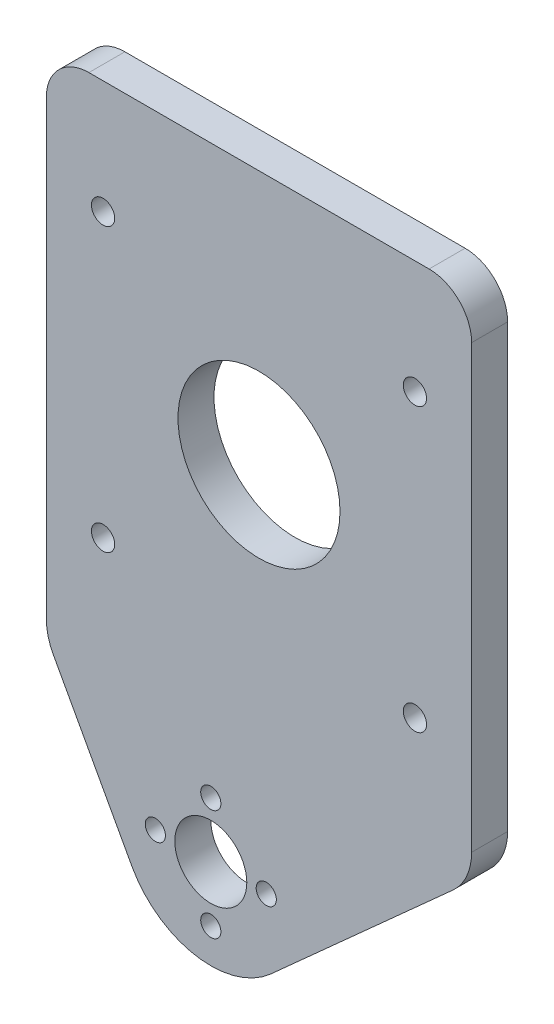
ISO-10303-21;
HEADER;
FILE_DESCRIPTION(('STEP AP214'),'2;1');
FILE_NAME('part.step','',(''),(''),'','','');
FILE_SCHEMA(('AUTOMOTIVE_DESIGN { 1 0 10303 214 1 1 1 1 }'));
ENDSEC;
DATA;
#1=APPLICATION_CONTEXT('core data for automotive mechanical design processes');
#2=APPLICATION_PROTOCOL_DEFINITION('international standard','automotive_design',2000,#1);
#3=PRODUCT_CONTEXT('',#1,'mechanical');
#4=PRODUCT('Part','Part','',(#3));
#5=PRODUCT_RELATED_PRODUCT_CATEGORY('part','',(#4));
#6=PRODUCT_DEFINITION_FORMATION('','',#4);
#7=PRODUCT_DEFINITION_CONTEXT('part definition',#1,'design');
#8=PRODUCT_DEFINITION('design','',#6,#7);
#9=PRODUCT_DEFINITION_SHAPE('','',#8);
#10=(LENGTH_UNIT() NAMED_UNIT(*) SI_UNIT(.MILLI.,.METRE.));
#11=(NAMED_UNIT(*) PLANE_ANGLE_UNIT() SI_UNIT($,.RADIAN.));
#12=(NAMED_UNIT(*) SI_UNIT($,.STERADIAN.) SOLID_ANGLE_UNIT());
#13=UNCERTAINTY_MEASURE_WITH_UNIT(LENGTH_MEASURE(1.E-05),#10,'distance_accuracy_value','');
#14=(GEOMETRIC_REPRESENTATION_CONTEXT(3) GLOBAL_UNCERTAINTY_ASSIGNED_CONTEXT((#13)) GLOBAL_UNIT_ASSIGNED_CONTEXT((#10,
#11,#12)) REPRESENTATION_CONTEXT('',''));
#15=CARTESIAN_POINT('',(0.,0.,0.));
#16=DIRECTION('',(0.,0.,1.));
#17=DIRECTION('',(1.,0.,0.));
#18=AXIS2_PLACEMENT_3D('',#15,#16,#17);
#19=CARTESIAN_POINT('',(0.,0.,6.35));
#20=DIRECTION('',(0.,0.,-1.));
#21=DIRECTION('',(-1.,0.,0.));
#22=AXIS2_PLACEMENT_3D('',#19,#20,#21);
#23=PLANE('',#22);
#24=CARTESIAN_POINT('',(179.9,20.,6.35));
#25=DIRECTION('',(0.,0.,1.));
#26=DIRECTION('',(-1.,0.,0.));
#27=AXIS2_PLACEMENT_3D('',#24,#25,#26);
#28=CIRCLE('',#27,2.04999999999999);
#29=CARTESIAN_POINT('',(177.85,20.,6.35));
#30=VERTEX_POINT('',#29);
#31=EDGE_CURVE('E301',#30,#30,#28,.T.);
#32=ORIENTED_EDGE('',*,*,#31,.F.);
#33=EDGE_LOOP('',(#32));
#34=FACE_BOUND('',#33,.T.);
#35=CARTESIAN_POINT('',(124.9,20.,6.35));
#36=DIRECTION('',(0.,0.,1.));
#37=DIRECTION('',(-1.,0.,0.));
#38=AXIS2_PLACEMENT_3D('',#35,#36,#37);
#39=CIRCLE('',#38,2.05000000000001);
#40=CARTESIAN_POINT('',(122.85,20.,6.35));
#41=VERTEX_POINT('',#40);
#42=EDGE_CURVE('E305',#41,#41,#39,.T.);
#43=ORIENTED_EDGE('',*,*,#42,.F.);
#44=EDGE_LOOP('',(#43));
#45=FACE_BOUND('',#44,.T.);
#46=CARTESIAN_POINT('',(124.9,69.8,6.35));
#47=DIRECTION('',(0.,0.,1.));
#48=DIRECTION('',(1.,0.,0.));
#49=AXIS2_PLACEMENT_3D('',#46,#47,#48);
#50=CIRCLE('',#49,2.05000000000001);
#51=CARTESIAN_POINT('',(126.95,69.8,6.35));
#52=VERTEX_POINT('',#51);
#53=EDGE_CURVE('E300',#52,#52,#50,.T.);
#54=ORIENTED_EDGE('',*,*,#53,.F.);
#55=EDGE_LOOP('',(#54));
#56=FACE_BOUND('',#55,.T.);
#57=CARTESIAN_POINT('',(179.9,69.8,6.35));
#58=DIRECTION('',(0.,0.,1.));
#59=DIRECTION('',(1.,0.,0.));
#60=AXIS2_PLACEMENT_3D('',#57,#58,#59);
#61=CIRCLE('',#60,2.04999999999999);
#62=CARTESIAN_POINT('',(181.95,69.8,6.35));
#63=VERTEX_POINT('',#62);
#64=EDGE_CURVE('E237',#63,#63,#61,.T.);
#65=ORIENTED_EDGE('',*,*,#64,.F.);
#66=EDGE_LOOP('',(#65));
#67=FACE_BOUND('',#66,.T.);
#68=CARTESIAN_POINT('',(152.4,44.9,6.35));
#69=DIRECTION('',(0.,0.,1.));
#70=DIRECTION('',(1.,0.,0.));
#71=AXIS2_PLACEMENT_3D('',#68,#69,#70);
#72=CIRCLE('',#71,14.2875);
#73=CARTESIAN_POINT('',(166.6875,44.9,6.35));
#74=VERTEX_POINT('',#73);
#75=EDGE_CURVE('E172',#74,#74,#72,.T.);
#76=ORIENTED_EDGE('',*,*,#75,.F.);
#77=EDGE_LOOP('',(#76));
#78=FACE_BOUND('',#77,.T.);
#79=DIRECTION('',(-1.,0.,0.));
#80=VECTOR('',#79,1.);
#81=CARTESIAN_POINT('',(0.,89.8,6.35));
#82=LINE('',#81,#80);
#83=CARTESIAN_POINT('',(182.4,89.8,6.35));
#84=VERTEX_POINT('',#83);
#85=CARTESIAN_POINT('',(122.4,89.8,6.35));
#86=VERTEX_POINT('',#85);
#87=EDGE_CURVE('E180',#84,#86,#82,.T.);
#88=ORIENTED_EDGE('',*,*,#87,.T.);
#89=CARTESIAN_POINT('',(122.4,82.3,6.35));
#90=DIRECTION('',(0.,0.,-1.));
#91=DIRECTION('',(-1.,0.,0.));
#92=AXIS2_PLACEMENT_3D('',#89,#90,#91);
#93=CIRCLE('',#92,7.5);
#94=CARTESIAN_POINT('',(114.9,82.3,6.35));
#95=VERTEX_POINT('',#94);
#96=EDGE_CURVE('E223',#86,#95,#93,.F.);
#97=ORIENTED_EDGE('',*,*,#96,.T.);
#98=DIRECTION('',(0.,1.,0.));
#99=VECTOR('',#98,1.);
#100=CARTESIAN_POINT('',(114.9,0.,6.35));
#101=LINE('',#100,#99);
#102=CARTESIAN_POINT('',(114.9,2.55111352936032,6.35));
#103=VERTEX_POINT('',#102);
#104=EDGE_CURVE('E162',#103,#95,#101,.T.);
#105=ORIENTED_EDGE('',*,*,#104,.F.);
#106=CARTESIAN_POINT('',(124.9,2.55111352936032,6.35));
#107=DIRECTION('',(0.,0.,-1.));
#108=DIRECTION('',(-1.,0.,0.));
#109=AXIS2_PLACEMENT_3D('',#106,#107,#108);
#110=CIRCLE('',#109,10.);
#111=CARTESIAN_POINT('',(116.122099603061,-2.23934204620073,6.35));
#112=VERTEX_POINT('',#111);
#113=EDGE_CURVE('E194',#103,#112,#110,.F.);
#114=ORIENTED_EDGE('',*,*,#113,.T.);
#115=DIRECTION('',(0.479045557556106,-0.877790039693867,0.));
#116=VECTOR('',#115,1.);
#117=CARTESIAN_POINT('',(114.9,0.,6.35));
#118=LINE('',#117,#116);
#119=CARTESIAN_POINT('',(129.96508311986,-27.6048482262032,6.35));
#120=VERTEX_POINT('',#119);
#121=EDGE_CURVE('E278',#112,#120,#118,.T.);
#122=ORIENTED_EDGE('',*,*,#121,.T.);
#123=CARTESIAN_POINT('',(143.9,-20.,6.35));
#124=DIRECTION('',(0.,0.,1.));
#125=DIRECTION('',(1.,0.,0.));
#126=AXIS2_PLACEMENT_3D('',#123,#124,#125);
#127=CIRCLE('',#126,15.875);
#128=CARTESIAN_POINT('',(154.51200148281,-31.8068221604642,6.35));
#129=VERTEX_POINT('',#128);
#130=EDGE_CURVE('E147',#120,#129,#127,.T.);
#131=ORIENTED_EDGE('',*,*,#130,.T.);
#132=DIRECTION('',(0.743736829005616,0.668472534350269,0.));
#133=VECTOR('',#132,1.);
#134=CARTESIAN_POINT('',(189.9,0.,6.35));
#135=LINE('',#134,#133);
#136=CARTESIAN_POINT('',(186.584725343503,-2.97977720783174,6.35));
#137=VERTEX_POINT('',#136);
#138=EDGE_CURVE('E259',#129,#137,#135,.T.);
#139=ORIENTED_EDGE('',*,*,#138,.T.);
#140=CARTESIAN_POINT('',(179.9,4.45759108222442,6.34999999999999));
#141=DIRECTION('',(0.,0.,-1.));
#142=DIRECTION('',(-1.,0.,0.));
#143=AXIS2_PLACEMENT_3D('',#140,#141,#142);
#144=CIRCLE('',#143,10.);
#145=CARTESIAN_POINT('',(189.9,4.45759108222442,6.35));
#146=VERTEX_POINT('',#145);
#147=EDGE_CURVE('E191',#137,#146,#144,.F.);
#148=ORIENTED_EDGE('',*,*,#147,.T.);
#149=DIRECTION('',(0.,1.,0.));
#150=VECTOR('',#149,1.);
#151=CARTESIAN_POINT('',(189.9,0.,6.35));
#152=LINE('',#151,#150);
#153=CARTESIAN_POINT('',(189.9,82.3,6.35));
#154=VERTEX_POINT('',#153);
#155=EDGE_CURVE('E157',#146,#154,#152,.T.);
#156=ORIENTED_EDGE('',*,*,#155,.T.);
#157=CARTESIAN_POINT('',(182.4,82.3,6.35));
#158=DIRECTION('',(0.,0.,-1.));
#159=DIRECTION('',(-1.,0.,0.));
#160=AXIS2_PLACEMENT_3D('',#157,#158,#159);
#161=CIRCLE('',#160,7.5);
#162=EDGE_CURVE('E220',#154,#84,#161,.F.);
#163=ORIENTED_EDGE('',*,*,#162,.T.);
#164=EDGE_LOOP('',(#88,#97,#105,#114,#122,#131,#139,#148,#156,#163));
#165=FACE_BOUND('',#164,.T.);
#166=CARTESIAN_POINT('',(143.9,-10.221,6.35));
#167=DIRECTION('',(0.,0.,1.));
#168=DIRECTION('',(1.,0.,0.));
#169=AXIS2_PLACEMENT_3D('',#166,#167,#168);
#170=CIRCLE('',#169,1.77799999999998);
#171=CARTESIAN_POINT('',(145.678,-10.221,6.35));
#172=VERTEX_POINT('',#171);
#173=EDGE_CURVE('E274',#172,#172,#170,.T.);
#174=ORIENTED_EDGE('',*,*,#173,.F.);
#175=EDGE_LOOP('',(#174));
#176=FACE_BOUND('',#175,.T.);
#177=CARTESIAN_POINT('',(153.679,-20.,6.35));
#178=DIRECTION('',(0.,0.,1.));
#179=DIRECTION('',(1.,0.,0.));
#180=AXIS2_PLACEMENT_3D('',#177,#178,#179);
#181=CIRCLE('',#180,1.77800000000001);
#182=CARTESIAN_POINT('',(155.457,-20.,6.35));
#183=VERTEX_POINT('',#182);
#184=EDGE_CURVE('E279',#183,#183,#181,.T.);
#185=ORIENTED_EDGE('',*,*,#184,.F.);
#186=EDGE_LOOP('',(#185));
#187=FACE_BOUND('',#186,.T.);
#188=CARTESIAN_POINT('',(134.121,-20.,6.35));
#189=DIRECTION('',(0.,0.,1.));
#190=DIRECTION('',(1.,0.,0.));
#191=AXIS2_PLACEMENT_3D('',#188,#189,#190);
#192=CIRCLE('',#191,1.77800000000001);
#193=CARTESIAN_POINT('',(135.899,-20.,6.35));
#194=VERTEX_POINT('',#193);
#195=EDGE_CURVE('E283',#194,#194,#192,.T.);
#196=ORIENTED_EDGE('',*,*,#195,.F.);
#197=EDGE_LOOP('',(#196));
#198=FACE_BOUND('',#197,.T.);
#199=CARTESIAN_POINT('',(143.9,-29.779,6.35));
#200=DIRECTION('',(0.,0.,1.));
#201=DIRECTION('',(1.,0.,0.));
#202=AXIS2_PLACEMENT_3D('',#199,#200,#201);
#203=CIRCLE('',#202,1.77800000000001);
#204=CARTESIAN_POINT('',(145.678,-29.779,6.35));
#205=VERTEX_POINT('',#204);
#206=EDGE_CURVE('E153',#205,#205,#203,.T.);
#207=ORIENTED_EDGE('',*,*,#206,.F.);
#208=EDGE_LOOP('',(#207));
#209=FACE_BOUND('',#208,.T.);
#210=CARTESIAN_POINT('',(143.9,-20.,6.35));
#211=DIRECTION('',(0.,0.,1.));
#212=DIRECTION('',(1.,0.,0.));
#213=AXIS2_PLACEMENT_3D('',#210,#211,#212);
#214=CIRCLE('',#213,6.35);
#215=CARTESIAN_POINT('',(150.25,-20.,6.35));
#216=VERTEX_POINT('',#215);
#217=EDGE_CURVE('E149',#216,#216,#214,.T.);
#218=ORIENTED_EDGE('',*,*,#217,.F.);
#219=EDGE_LOOP('',(#218));
#220=FACE_BOUND('',#219,.T.);
#221=ADVANCED_FACE('F39',(#34,#45,#56,#67,#78,#165,#176,#187,#198,#209,#220),#23,.F.);
#222=CARTESIAN_POINT('',(0.,0.,0.));
#223=DIRECTION('',(0.,0.,-1.));
#224=DIRECTION('',(-1.,0.,0.));
#225=AXIS2_PLACEMENT_3D('',#222,#223,#224);
#226=PLANE('',#225);
#227=CARTESIAN_POINT('',(179.9,20.,0.));
#228=DIRECTION('',(0.,0.,-1.));
#229=DIRECTION('',(-1.,0.,0.));
#230=AXIS2_PLACEMENT_3D('',#227,#228,#229);
#231=CIRCLE('',#230,2.04999999999999);
#232=CARTESIAN_POINT('',(177.85,20.,0.));
#233=VERTEX_POINT('',#232);
#234=EDGE_CURVE('E43',#233,#233,#231,.T.);
#235=ORIENTED_EDGE('',*,*,#234,.F.);
#236=EDGE_LOOP('',(#235));
#237=FACE_BOUND('',#236,.T.);
#238=CARTESIAN_POINT('',(124.9,20.,0.));
#239=DIRECTION('',(0.,0.,-1.));
#240=DIRECTION('',(-1.,0.,0.));
#241=AXIS2_PLACEMENT_3D('',#238,#239,#240);
#242=CIRCLE('',#241,2.05000000000001);
#243=CARTESIAN_POINT('',(122.85,20.,0.));
#244=VERTEX_POINT('',#243);
#245=EDGE_CURVE('E240',#244,#244,#242,.T.);
#246=ORIENTED_EDGE('',*,*,#245,.F.);
#247=EDGE_LOOP('',(#246));
#248=FACE_BOUND('',#247,.T.);
#249=CARTESIAN_POINT('',(124.9,69.8,0.));
#250=DIRECTION('',(0.,0.,-1.));
#251=DIRECTION('',(-1.,0.,0.));
#252=AXIS2_PLACEMENT_3D('',#249,#250,#251);
#253=CIRCLE('',#252,2.05000000000001);
#254=CARTESIAN_POINT('',(122.85,69.8,0.));
#255=VERTEX_POINT('',#254);
#256=EDGE_CURVE('E236',#255,#255,#253,.T.);
#257=ORIENTED_EDGE('',*,*,#256,.F.);
#258=EDGE_LOOP('',(#257));
#259=FACE_BOUND('',#258,.T.);
#260=CARTESIAN_POINT('',(179.9,69.8,0.));
#261=DIRECTION('',(0.,0.,-1.));
#262=DIRECTION('',(-1.,0.,0.));
#263=AXIS2_PLACEMENT_3D('',#260,#261,#262);
#264=CIRCLE('',#263,2.04999999999999);
#265=CARTESIAN_POINT('',(177.85,69.8,0.));
#266=VERTEX_POINT('',#265);
#267=EDGE_CURVE('E232',#266,#266,#264,.T.);
#268=ORIENTED_EDGE('',*,*,#267,.F.);
#269=EDGE_LOOP('',(#268));
#270=FACE_BOUND('',#269,.T.);
#271=CARTESIAN_POINT('',(152.4,44.9,0.));
#272=DIRECTION('',(0.,0.,1.));
#273=DIRECTION('',(1.,0.,0.));
#274=AXIS2_PLACEMENT_3D('',#271,#272,#273);
#275=CIRCLE('',#274,14.2875);
#276=CARTESIAN_POINT('',(166.6875,44.9,0.));
#277=VERTEX_POINT('',#276);
#278=EDGE_CURVE('E171',#277,#277,#275,.T.);
#279=ORIENTED_EDGE('',*,*,#278,.T.);
#280=EDGE_LOOP('',(#279));
#281=FACE_BOUND('',#280,.T.);
#282=DIRECTION('',(0.,-1.,0.));
#283=VECTOR('',#282,1.);
#284=CARTESIAN_POINT('',(114.9,0.,0.));
#285=LINE('',#284,#283);
#286=CARTESIAN_POINT('',(114.9,82.3,0.));
#287=VERTEX_POINT('',#286);
#288=CARTESIAN_POINT('',(114.9,2.55111352936032,0.));
#289=VERTEX_POINT('',#288);
#290=EDGE_CURVE('E161',#287,#289,#285,.T.);
#291=ORIENTED_EDGE('',*,*,#290,.F.);
#292=CARTESIAN_POINT('',(122.4,82.3,0.));
#293=DIRECTION('',(0.,0.,-1.));
#294=DIRECTION('',(-1.,0.,0.));
#295=AXIS2_PLACEMENT_3D('',#292,#293,#294);
#296=CIRCLE('',#295,7.5);
#297=CARTESIAN_POINT('',(122.4,89.8,0.));
#298=VERTEX_POINT('',#297);
#299=EDGE_CURVE('E49',#287,#298,#296,.T.);
#300=ORIENTED_EDGE('',*,*,#299,.T.);
#301=DIRECTION('',(-1.,0.,0.));
#302=VECTOR('',#301,1.);
#303=CARTESIAN_POINT('',(0.,89.8,0.));
#304=LINE('',#303,#302);
#305=CARTESIAN_POINT('',(182.4,89.8,0.));
#306=VERTEX_POINT('',#305);
#307=EDGE_CURVE('E176',#306,#298,#304,.T.);
#308=ORIENTED_EDGE('',*,*,#307,.F.);
#309=CARTESIAN_POINT('',(182.4,82.3,0.));
#310=DIRECTION('',(0.,0.,-1.));
#311=DIRECTION('',(-1.,0.,0.));
#312=AXIS2_PLACEMENT_3D('',#309,#310,#311);
#313=CIRCLE('',#312,7.5);
#314=CARTESIAN_POINT('',(189.9,82.3,0.));
#315=VERTEX_POINT('',#314);
#316=EDGE_CURVE('E57',#306,#315,#313,.T.);
#317=ORIENTED_EDGE('',*,*,#316,.T.);
#318=DIRECTION('',(0.,-1.,0.));
#319=VECTOR('',#318,1.);
#320=CARTESIAN_POINT('',(189.9,0.,0.));
#321=LINE('',#320,#319);
#322=CARTESIAN_POINT('',(189.9,4.45759108222442,0.));
#323=VERTEX_POINT('',#322);
#324=EDGE_CURVE('E168',#315,#323,#321,.T.);
#325=ORIENTED_EDGE('',*,*,#324,.T.);
#326=CARTESIAN_POINT('',(179.9,4.45759108222442,0.));
#327=DIRECTION('',(0.,0.,-1.));
#328=DIRECTION('',(-1.,0.,0.));
#329=AXIS2_PLACEMENT_3D('',#326,#327,#328);
#330=CIRCLE('',#329,10.);
#331=CARTESIAN_POINT('',(186.584725343503,-2.97977720783174,0.));
#332=VERTEX_POINT('',#331);
#333=EDGE_CURVE('E199',#323,#332,#330,.T.);
#334=ORIENTED_EDGE('',*,*,#333,.T.);
#335=DIRECTION('',(0.743736829005616,0.668472534350269,0.));
#336=VECTOR('',#335,1.);
#337=CARTESIAN_POINT('',(189.9,0.,0.));
#338=LINE('',#337,#336);
#339=CARTESIAN_POINT('',(154.51200148281,-31.8068221604642,0.));
#340=VERTEX_POINT('',#339);
#341=EDGE_CURVE('E140',#340,#332,#338,.T.);
#342=ORIENTED_EDGE('',*,*,#341,.F.);
#343=CARTESIAN_POINT('',(143.9,-20.,0.));
#344=DIRECTION('',(0.,0.,-1.));
#345=DIRECTION('',(-1.,0.,0.));
#346=AXIS2_PLACEMENT_3D('',#343,#344,#345);
#347=CIRCLE('',#346,15.875);
#348=CARTESIAN_POINT('',(129.96508311986,-27.6048482262032,0.));
#349=VERTEX_POINT('',#348);
#350=EDGE_CURVE('E136',#349,#340,#347,.F.);
#351=ORIENTED_EDGE('',*,*,#350,.F.);
#352=DIRECTION('',(0.479045557556106,-0.877790039693867,0.));
#353=VECTOR('',#352,1.);
#354=CARTESIAN_POINT('',(114.9,0.,0.));
#355=LINE('',#354,#353);
#356=CARTESIAN_POINT('',(116.122099603061,-2.23934204620074,0.));
#357=VERTEX_POINT('',#356);
#358=EDGE_CURVE('E121',#357,#349,#355,.T.);
#359=ORIENTED_EDGE('',*,*,#358,.F.);
#360=CARTESIAN_POINT('',(124.9,2.55111352936032,0.));
#361=DIRECTION('',(0.,0.,-1.));
#362=DIRECTION('',(-1.,0.,0.));
#363=AXIS2_PLACEMENT_3D('',#360,#361,#362);
#364=CIRCLE('',#363,10.);
#365=EDGE_CURVE('E202',#357,#289,#364,.T.);
#366=ORIENTED_EDGE('',*,*,#365,.T.);
#367=EDGE_LOOP('',(#291,#300,#308,#317,#325,#334,#342,#351,#359,#366));
#368=FACE_BOUND('',#367,.T.);
#369=CARTESIAN_POINT('',(143.9,-29.779,0.));
#370=DIRECTION('',(0.,0.,-1.));
#371=DIRECTION('',(-1.,0.,0.));
#372=AXIS2_PLACEMENT_3D('',#369,#370,#371);
#373=CIRCLE('',#372,1.77800000000001);
#374=CARTESIAN_POINT('',(142.122,-29.779,0.));
#375=VERTEX_POINT('',#374);
#376=EDGE_CURVE('E254',#375,#375,#373,.F.);
#377=ORIENTED_EDGE('',*,*,#376,.T.);
#378=EDGE_LOOP('',(#377));
#379=FACE_BOUND('',#378,.T.);
#380=CARTESIAN_POINT('',(153.679,-20.,0.));
#381=DIRECTION('',(0.,0.,-1.));
#382=DIRECTION('',(-1.,0.,0.));
#383=AXIS2_PLACEMENT_3D('',#380,#381,#382);
#384=CIRCLE('',#383,1.77800000000001);
#385=CARTESIAN_POINT('',(151.901,-20.,0.));
#386=VERTEX_POINT('',#385);
#387=EDGE_CURVE('E258',#386,#386,#384,.F.);
#388=ORIENTED_EDGE('',*,*,#387,.T.);
#389=EDGE_LOOP('',(#388));
#390=FACE_BOUND('',#389,.T.);
#391=CARTESIAN_POINT('',(143.9,-10.221,0.));
#392=DIRECTION('',(0.,0.,-1.));
#393=DIRECTION('',(-1.,0.,0.));
#394=AXIS2_PLACEMENT_3D('',#391,#392,#393);
#395=CIRCLE('',#394,1.77799999999998);
#396=CARTESIAN_POINT('',(142.122,-10.221,0.));
#397=VERTEX_POINT('',#396);
#398=EDGE_CURVE('E263',#397,#397,#395,.F.);
#399=ORIENTED_EDGE('',*,*,#398,.T.);
#400=EDGE_LOOP('',(#399));
#401=FACE_BOUND('',#400,.T.);
#402=CARTESIAN_POINT('',(134.121,-20.,0.));
#403=DIRECTION('',(0.,0.,-1.));
#404=DIRECTION('',(-1.,0.,0.));
#405=AXIS2_PLACEMENT_3D('',#402,#403,#404);
#406=CIRCLE('',#405,1.77800000000001);
#407=CARTESIAN_POINT('',(132.343,-20.,0.));
#408=VERTEX_POINT('',#407);
#409=EDGE_CURVE('E267',#408,#408,#406,.F.);
#410=ORIENTED_EDGE('',*,*,#409,.T.);
#411=EDGE_LOOP('',(#410));
#412=FACE_BOUND('',#411,.T.);
#413=CARTESIAN_POINT('',(143.9,-20.,0.));
#414=DIRECTION('',(0.,0.,-1.));
#415=DIRECTION('',(-1.,0.,0.));
#416=AXIS2_PLACEMENT_3D('',#413,#414,#415);
#417=CIRCLE('',#416,6.35);
#418=CARTESIAN_POINT('',(137.55,-20.,0.));
#419=VERTEX_POINT('',#418);
#420=EDGE_CURVE('E165',#419,#419,#417,.F.);
#421=ORIENTED_EDGE('',*,*,#420,.T.);
#422=EDGE_LOOP('',(#421));
#423=FACE_BOUND('',#422,.T.);
#424=ADVANCED_FACE('F137',(#237,#248,#259,#270,#281,#368,#379,#390,#401,#412,#423),#226,.T.);
#425=CARTESIAN_POINT('',(0.,89.8,6.35));
#426=DIRECTION('',(0.,-1.,0.));
#427=DIRECTION('',(0.,0.,-1.));
#428=AXIS2_PLACEMENT_3D('',#425,#426,#427);
#429=PLANE('',#428);
#430=ORIENTED_EDGE('',*,*,#307,.T.);
#431=DIRECTION('',(0.,0.,1.));
#432=VECTOR('',#431,1.);
#433=CARTESIAN_POINT('',(122.4,89.8,6.35));
#434=LINE('',#433,#432);
#435=EDGE_CURVE('E216',#298,#86,#434,.T.);
#436=ORIENTED_EDGE('',*,*,#435,.T.);
#437=ORIENTED_EDGE('',*,*,#87,.F.);
#438=DIRECTION('',(0.,0.,1.));
#439=VECTOR('',#438,1.);
#440=CARTESIAN_POINT('',(182.4,89.8,0.));
#441=LINE('',#440,#439);
#442=EDGE_CURVE('E213',#84,#306,#441,.F.);
#443=ORIENTED_EDGE('',*,*,#442,.T.);
#444=EDGE_LOOP('',(#430,#436,#437,#443));
#445=FACE_BOUND('',#444,.T.);
#446=ADVANCED_FACE('F343',(#445),#429,.F.);
#447=CARTESIAN_POINT('',(152.4,44.9,6.35));
#448=DIRECTION('',(0.,0.,-1.));
#449=DIRECTION('',(-1.,0.,0.));
#450=AXIS2_PLACEMENT_3D('',#447,#448,#449);
#451=CYLINDRICAL_SURFACE('',#450,14.2875);
#452=ORIENTED_EDGE('',*,*,#75,.T.);
#453=EDGE_LOOP('',(#452));
#454=FACE_BOUND('',#453,.T.);
#455=ORIENTED_EDGE('',*,*,#278,.F.);
#456=EDGE_LOOP('',(#455));
#457=FACE_BOUND('',#456,.T.);
#458=ADVANCED_FACE('F349',(#454,#457),#451,.F.);
#459=CARTESIAN_POINT('',(114.9,0.,-3.65));
#460=DIRECTION('',(1.,0.,0.));
#461=DIRECTION('',(0.,0.,-1.));
#462=AXIS2_PLACEMENT_3D('',#459,#460,#461);
#463=PLANE('',#462);
#464=ORIENTED_EDGE('',*,*,#104,.T.);
#465=DIRECTION('',(0.,0.,1.));
#466=VECTOR('',#465,1.);
#467=CARTESIAN_POINT('',(114.9,82.3,-3.65));
#468=LINE('',#467,#466);
#469=EDGE_CURVE('E65',#95,#287,#468,.F.);
#470=ORIENTED_EDGE('',*,*,#469,.T.);
#471=ORIENTED_EDGE('',*,*,#290,.T.);
#472=DIRECTION('',(0.,0.,1.));
#473=VECTOR('',#472,1.);
#474=CARTESIAN_POINT('',(114.9,2.55111352936032,6.35));
#475=LINE('',#474,#473);
#476=EDGE_CURVE('E184',#289,#103,#475,.T.);
#477=ORIENTED_EDGE('',*,*,#476,.T.);
#478=EDGE_LOOP('',(#464,#470,#471,#477));
#479=FACE_BOUND('',#478,.T.);
#480=ADVANCED_FACE('F385',(#479),#463,.F.);
#481=CARTESIAN_POINT('',(189.9,0.,-3.65));
#482=DIRECTION('',(1.,0.,0.));
#483=DIRECTION('',(0.,0.,-1.));
#484=AXIS2_PLACEMENT_3D('',#481,#482,#483);
#485=PLANE('',#484);
#486=ORIENTED_EDGE('',*,*,#324,.F.);
#487=DIRECTION('',(0.,0.,1.));
#488=VECTOR('',#487,1.);
#489=CARTESIAN_POINT('',(189.9,82.3,6.35));
#490=LINE('',#489,#488);
#491=EDGE_CURVE('E11',#315,#154,#490,.T.);
#492=ORIENTED_EDGE('',*,*,#491,.T.);
#493=ORIENTED_EDGE('',*,*,#155,.F.);
#494=DIRECTION('',(0.,0.,1.));
#495=VECTOR('',#494,1.);
#496=CARTESIAN_POINT('',(189.9,4.45759108222442,-3.65));
#497=LINE('',#496,#495);
#498=EDGE_CURVE('E209',#146,#323,#497,.F.);
#499=ORIENTED_EDGE('',*,*,#498,.T.);
#500=EDGE_LOOP('',(#486,#492,#493,#499));
#501=FACE_BOUND('',#500,.T.);
#502=ADVANCED_FACE('F377',(#501),#485,.T.);
#503=CARTESIAN_POINT('',(189.9,0.,-83.1385327330234));
#504=DIRECTION('',(0.668472534350269,-0.743736829005616,0.));
#505=DIRECTION('',(0.743736829005616,0.668472534350269,0.));
#506=AXIS2_PLACEMENT_3D('',#503,#504,#505);
#507=PLANE('',#506);
#508=ORIENTED_EDGE('',*,*,#341,.T.);
#509=DIRECTION('',(0.,0.,1.));
#510=VECTOR('',#509,1.);
#511=CARTESIAN_POINT('',(186.584725343503,-2.97977720783174,-83.1385327330234));
#512=LINE('',#511,#510);
#513=EDGE_CURVE('E205',#332,#137,#512,.T.);
#514=ORIENTED_EDGE('',*,*,#513,.T.);
#515=ORIENTED_EDGE('',*,*,#138,.F.);
#516=DIRECTION('',(0.,0.,1.));
#517=VECTOR('',#516,1.);
#518=CARTESIAN_POINT('',(154.51200148281,-31.8068221604642,-83.1385327330234));
#519=LINE('',#518,#517);
#520=EDGE_CURVE('E133',#340,#129,#519,.T.);
#521=ORIENTED_EDGE('',*,*,#520,.F.);
#522=EDGE_LOOP('',(#508,#514,#515,#521));
#523=FACE_BOUND('',#522,.T.);
#524=ADVANCED_FACE('F381',(#523),#507,.T.);
#525=CARTESIAN_POINT('',(143.9,-20.,-83.1385327330234));
#526=DIRECTION('',(0.,0.,1.));
#527=DIRECTION('',(1.,0.,0.));
#528=AXIS2_PLACEMENT_3D('',#525,#526,#527);
#529=CYLINDRICAL_SURFACE('',#528,15.875);
#530=DIRECTION('',(0.,0.,1.));
#531=VECTOR('',#530,1.);
#532=CARTESIAN_POINT('',(129.96508311986,-27.6048482262032,-83.1385327330234));
#533=LINE('',#532,#531);
#534=EDGE_CURVE('E126',#349,#120,#533,.T.);
#535=ORIENTED_EDGE('',*,*,#534,.F.);
#536=ORIENTED_EDGE('',*,*,#350,.T.);
#537=ORIENTED_EDGE('',*,*,#520,.T.);
#538=ORIENTED_EDGE('',*,*,#130,.F.);
#539=EDGE_LOOP('',(#535,#536,#537,#538));
#540=FACE_BOUND('',#539,.T.);
#541=ADVANCED_FACE('F145',(#540),#529,.T.);
#542=CARTESIAN_POINT('',(114.9,0.,-83.1385327330234));
#543=DIRECTION('',(-0.877790039693867,-0.479045557556106,0.));
#544=DIRECTION('',(0.479045557556106,-0.877790039693867,0.));
#545=AXIS2_PLACEMENT_3D('',#542,#543,#544);
#546=PLANE('',#545);
#547=ORIENTED_EDGE('',*,*,#121,.F.);
#548=DIRECTION('',(0.,0.,1.));
#549=VECTOR('',#548,1.);
#550=CARTESIAN_POINT('',(116.122099603061,-2.23934204620074,0.));
#551=LINE('',#550,#549);
#552=EDGE_CURVE('E129',#112,#357,#551,.F.);
#553=ORIENTED_EDGE('',*,*,#552,.T.);
#554=ORIENTED_EDGE('',*,*,#358,.T.);
#555=ORIENTED_EDGE('',*,*,#534,.T.);
#556=EDGE_LOOP('',(#547,#553,#554,#555));
#557=FACE_BOUND('',#556,.T.);
#558=ADVANCED_FACE('F124',(#557),#546,.T.);
#559=CARTESIAN_POINT('',(143.9,-20.,-83.1385327330234));
#560=DIRECTION('',(0.,0.,1.));
#561=DIRECTION('',(1.,0.,0.));
#562=AXIS2_PLACEMENT_3D('',#559,#560,#561);
#563=CYLINDRICAL_SURFACE('',#562,6.35);
#564=ORIENTED_EDGE('',*,*,#217,.T.);
#565=EDGE_LOOP('',(#564));
#566=FACE_BOUND('',#565,.T.);
#567=ORIENTED_EDGE('',*,*,#420,.F.);
#568=EDGE_LOOP('',(#567));
#569=FACE_BOUND('',#568,.T.);
#570=ADVANCED_FACE('F335',(#566,#569),#563,.F.);
#571=CARTESIAN_POINT('',(143.9,-29.779,-83.1385327330234));
#572=DIRECTION('',(0.,0.,1.));
#573=DIRECTION('',(1.,0.,0.));
#574=AXIS2_PLACEMENT_3D('',#571,#572,#573);
#575=CYLINDRICAL_SURFACE('',#574,1.77800000000001);
#576=ORIENTED_EDGE('',*,*,#206,.T.);
#577=EDGE_LOOP('',(#576));
#578=FACE_BOUND('',#577,.T.);
#579=ORIENTED_EDGE('',*,*,#376,.F.);
#580=EDGE_LOOP('',(#579));
#581=FACE_BOUND('',#580,.T.);
#582=ADVANCED_FACE('F338',(#578,#581),#575,.F.);
#583=CARTESIAN_POINT('',(134.121,-20.,-83.1385327330234));
#584=DIRECTION('',(0.,0.,1.));
#585=DIRECTION('',(1.,0.,0.));
#586=AXIS2_PLACEMENT_3D('',#583,#584,#585);
#587=CYLINDRICAL_SURFACE('',#586,1.77800000000001);
#588=ORIENTED_EDGE('',*,*,#195,.T.);
#589=EDGE_LOOP('',(#588));
#590=FACE_BOUND('',#589,.T.);
#591=ORIENTED_EDGE('',*,*,#409,.F.);
#592=EDGE_LOOP('',(#591));
#593=FACE_BOUND('',#592,.T.);
#594=ADVANCED_FACE('F401',(#590,#593),#587,.F.);
#595=CARTESIAN_POINT('',(153.679,-20.,-83.1385327330234));
#596=DIRECTION('',(0.,0.,1.));
#597=DIRECTION('',(1.,0.,0.));
#598=AXIS2_PLACEMENT_3D('',#595,#596,#597);
#599=CYLINDRICAL_SURFACE('',#598,1.77800000000001);
#600=ORIENTED_EDGE('',*,*,#184,.T.);
#601=EDGE_LOOP('',(#600));
#602=FACE_BOUND('',#601,.T.);
#603=ORIENTED_EDGE('',*,*,#387,.F.);
#604=EDGE_LOOP('',(#603));
#605=FACE_BOUND('',#604,.T.);
#606=ADVANCED_FACE('F397',(#602,#605),#599,.F.);
#607=CARTESIAN_POINT('',(143.9,-10.221,-83.1385327330234));
#608=DIRECTION('',(0.,0.,1.));
#609=DIRECTION('',(1.,0.,0.));
#610=AXIS2_PLACEMENT_3D('',#607,#608,#609);
#611=CYLINDRICAL_SURFACE('',#610,1.77799999999998);
#612=ORIENTED_EDGE('',*,*,#173,.T.);
#613=EDGE_LOOP('',(#612));
#614=FACE_BOUND('',#613,.T.);
#615=ORIENTED_EDGE('',*,*,#398,.F.);
#616=EDGE_LOOP('',(#615));
#617=FACE_BOUND('',#616,.T.);
#618=ADVANCED_FACE('F359',(#614,#617),#611,.F.);
#619=CARTESIAN_POINT('',(124.9,2.55111352936032,-3.65));
#620=DIRECTION('',(0.,0.,-1.));
#621=DIRECTION('',(-1.,0.,0.));
#622=AXIS2_PLACEMENT_3D('',#619,#620,#621);
#623=CYLINDRICAL_SURFACE('',#622,10.);
#624=ORIENTED_EDGE('',*,*,#365,.F.);
#625=ORIENTED_EDGE('',*,*,#552,.F.);
#626=ORIENTED_EDGE('',*,*,#113,.F.);
#627=ORIENTED_EDGE('',*,*,#476,.F.);
#628=EDGE_LOOP('',(#624,#625,#626,#627));
#629=FACE_BOUND('',#628,.T.);
#630=ADVANCED_FACE('F355',(#629),#623,.T.);
#631=CARTESIAN_POINT('',(179.9,4.45759108222442,-83.1385327330234));
#632=DIRECTION('',(0.,0.,1.));
#633=DIRECTION('',(1.,0.,0.));
#634=AXIS2_PLACEMENT_3D('',#631,#632,#633);
#635=CYLINDRICAL_SURFACE('',#634,10.);
#636=ORIENTED_EDGE('',*,*,#333,.F.);
#637=ORIENTED_EDGE('',*,*,#498,.F.);
#638=ORIENTED_EDGE('',*,*,#147,.F.);
#639=ORIENTED_EDGE('',*,*,#513,.F.);
#640=EDGE_LOOP('',(#636,#637,#638,#639));
#641=FACE_BOUND('',#640,.T.);
#642=ADVANCED_FACE('F358',(#641),#635,.T.);
#643=CARTESIAN_POINT('',(122.4,82.3,6.35));
#644=DIRECTION('',(0.,0.,1.));
#645=DIRECTION('',(1.,0.,0.));
#646=AXIS2_PLACEMENT_3D('',#643,#644,#645);
#647=CYLINDRICAL_SURFACE('',#646,7.5);
#648=ORIENTED_EDGE('',*,*,#299,.F.);
#649=ORIENTED_EDGE('',*,*,#469,.F.);
#650=ORIENTED_EDGE('',*,*,#96,.F.);
#651=ORIENTED_EDGE('',*,*,#435,.F.);
#652=EDGE_LOOP('',(#648,#649,#650,#651));
#653=FACE_BOUND('',#652,.T.);
#654=ADVANCED_FACE('F362',(#653),#647,.T.);
#655=CARTESIAN_POINT('',(182.4,82.3,-3.65));
#656=DIRECTION('',(0.,0.,-1.));
#657=DIRECTION('',(-1.,0.,0.));
#658=AXIS2_PLACEMENT_3D('',#655,#656,#657);
#659=CYLINDRICAL_SURFACE('',#658,7.5);
#660=ORIENTED_EDGE('',*,*,#316,.F.);
#661=ORIENTED_EDGE('',*,*,#442,.F.);
#662=ORIENTED_EDGE('',*,*,#162,.F.);
#663=ORIENTED_EDGE('',*,*,#491,.F.);
#664=EDGE_LOOP('',(#660,#661,#662,#663));
#665=FACE_BOUND('',#664,.T.);
#666=ADVANCED_FACE('F41',(#665),#659,.T.);
#667=CARTESIAN_POINT('',(179.9,69.8,-3.65));
#668=DIRECTION('',(0.,0.,1.));
#669=DIRECTION('',(1.,0.,0.));
#670=AXIS2_PLACEMENT_3D('',#667,#668,#669);
#671=CYLINDRICAL_SURFACE('',#670,2.04999999999999);
#672=ORIENTED_EDGE('',*,*,#267,.T.);
#673=EDGE_LOOP('',(#672));
#674=FACE_BOUND('',#673,.T.);
#675=ORIENTED_EDGE('',*,*,#64,.T.);
#676=EDGE_LOOP('',(#675));
#677=FACE_BOUND('',#676,.T.);
#678=ADVANCED_FACE('F369',(#674,#677),#671,.F.);
#679=CARTESIAN_POINT('',(124.9,69.8,-3.65));
#680=DIRECTION('',(0.,0.,1.));
#681=DIRECTION('',(1.,0.,0.));
#682=AXIS2_PLACEMENT_3D('',#679,#680,#681);
#683=CYLINDRICAL_SURFACE('',#682,2.05000000000001);
#684=ORIENTED_EDGE('',*,*,#256,.T.);
#685=EDGE_LOOP('',(#684));
#686=FACE_BOUND('',#685,.T.);
#687=ORIENTED_EDGE('',*,*,#53,.T.);
#688=EDGE_LOOP('',(#687));
#689=FACE_BOUND('',#688,.T.);
#690=ADVANCED_FACE('F313',(#686,#689),#683,.F.);
#691=CARTESIAN_POINT('',(124.9,20.,-3.65));
#692=DIRECTION('',(0.,0.,1.));
#693=DIRECTION('',(1.,0.,0.));
#694=AXIS2_PLACEMENT_3D('',#691,#692,#693);
#695=CYLINDRICAL_SURFACE('',#694,2.05000000000001);
#696=ORIENTED_EDGE('',*,*,#245,.T.);
#697=EDGE_LOOP('',(#696));
#698=FACE_BOUND('',#697,.T.);
#699=ORIENTED_EDGE('',*,*,#42,.T.);
#700=EDGE_LOOP('',(#699));
#701=FACE_BOUND('',#700,.T.);
#702=ADVANCED_FACE('F421',(#698,#701),#695,.F.);
#703=CARTESIAN_POINT('',(179.9,20.,-3.65));
#704=DIRECTION('',(0.,0.,1.));
#705=DIRECTION('',(1.,0.,0.));
#706=AXIS2_PLACEMENT_3D('',#703,#704,#705);
#707=CYLINDRICAL_SURFACE('',#706,2.04999999999999);
#708=ORIENTED_EDGE('',*,*,#234,.T.);
#709=EDGE_LOOP('',(#708));
#710=FACE_BOUND('',#709,.T.);
#711=ORIENTED_EDGE('',*,*,#31,.T.);
#712=EDGE_LOOP('',(#711));
#713=FACE_BOUND('',#712,.T.);
#714=ADVANCED_FACE('F418',(#710,#713),#707,.F.);
#715=CLOSED_SHELL('',(#221,#424,#446,#458,#480,#502,#524,#541,#558,#570,#582,#594,#606,#618,
#630,#642,#654,#666,#678,#690,#702,#714));
#716=MANIFOLD_SOLID_BREP('B2',#715);
#717=ADVANCED_BREP_SHAPE_REPRESENTATION('',(#18,#716),#14);
#718=SHAPE_DEFINITION_REPRESENTATION(#9,#717);
ENDSEC;
END-ISO-10303-21;
